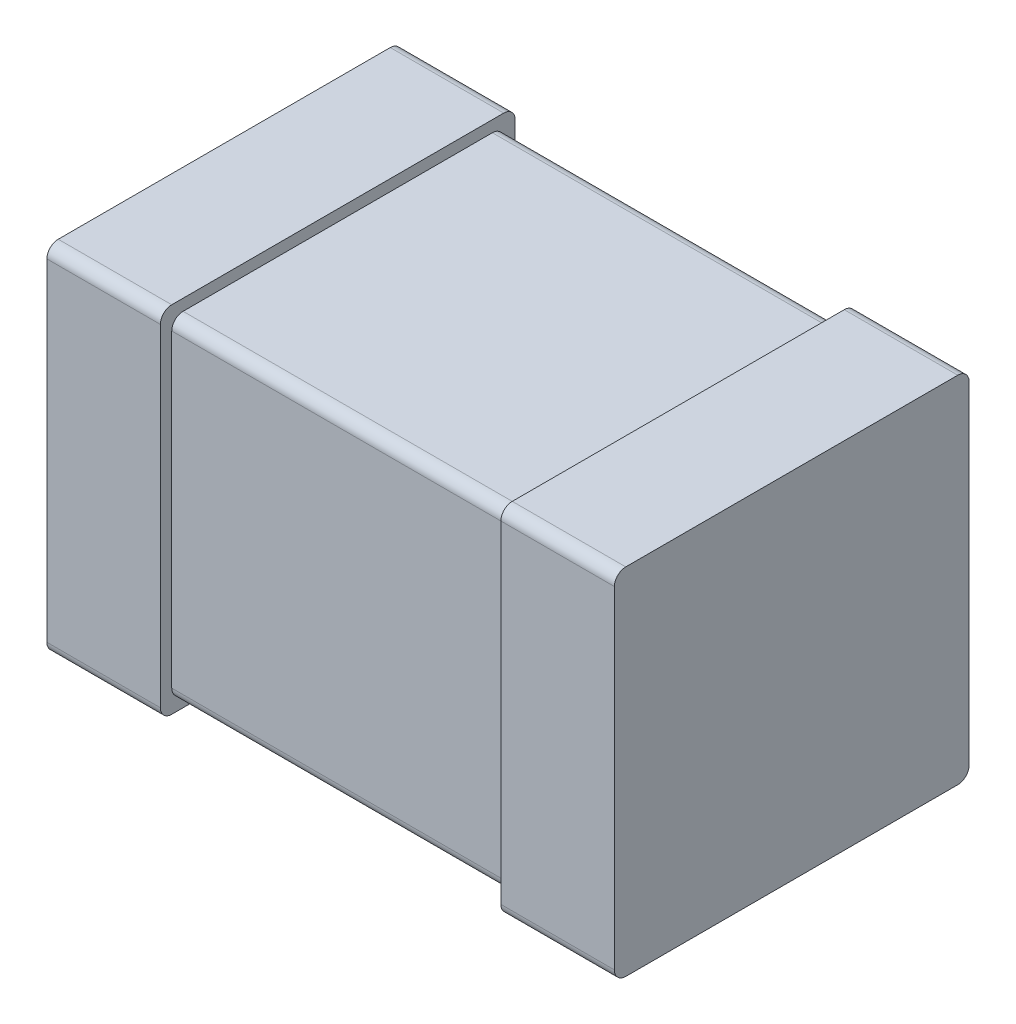
ISO-10303-21;
HEADER;
FILE_DESCRIPTION(('STEP AP214'),'2;1');
FILE_NAME('part.step','',(''),(''),'','','');
FILE_SCHEMA(('AUTOMOTIVE_DESIGN { 1 0 10303 214 1 1 1 1 }'));
ENDSEC;
DATA;
#1=APPLICATION_CONTEXT('core data for automotive mechanical design processes');
#2=APPLICATION_PROTOCOL_DEFINITION('international standard','automotive_design',2000,#1);
#3=PRODUCT_CONTEXT('',#1,'mechanical');
#4=PRODUCT('Part','Part','',(#3));
#5=PRODUCT_RELATED_PRODUCT_CATEGORY('part','',(#4));
#6=PRODUCT_DEFINITION_FORMATION('','',#4);
#7=PRODUCT_DEFINITION_CONTEXT('part definition',#1,'design');
#8=PRODUCT_DEFINITION('design','',#6,#7);
#9=PRODUCT_DEFINITION_SHAPE('','',#8);
#10=(LENGTH_UNIT() NAMED_UNIT(*) SI_UNIT(.MILLI.,.METRE.));
#11=(NAMED_UNIT(*) PLANE_ANGLE_UNIT() SI_UNIT($,.RADIAN.));
#12=(NAMED_UNIT(*) SI_UNIT($,.STERADIAN.) SOLID_ANGLE_UNIT());
#13=UNCERTAINTY_MEASURE_WITH_UNIT(LENGTH_MEASURE(1.E-05),#10,'distance_accuracy_value','');
#14=(GEOMETRIC_REPRESENTATION_CONTEXT(3) GLOBAL_UNCERTAINTY_ASSIGNED_CONTEXT((#13)) GLOBAL_UNIT_ASSIGNED_CONTEXT((#10,
#11,#12)) REPRESENTATION_CONTEXT('',''));
#15=CARTESIAN_POINT('',(0.,0.,0.));
#16=DIRECTION('',(0.,0.,1.));
#17=DIRECTION('',(1.,0.,0.));
#18=AXIS2_PLACEMENT_3D('',#15,#16,#17);
#19=CARTESIAN_POINT('',(1.,-0.625,0.));
#20=DIRECTION('',(1.,0.,0.));
#21=DIRECTION('',(0.,1.,0.));
#22=AXIS2_PLACEMENT_3D('',#19,#20,#21);
#23=PLANE('',#22);
#24=DIRECTION('',(0.,0.,1.));
#25=VECTOR('',#24,1.);
#26=CARTESIAN_POINT('',(1.,-0.625,0.));
#27=LINE('',#26,#25);
#28=CARTESIAN_POINT('',(1.,-0.625,0.04));
#29=VERTEX_POINT('',#28);
#30=CARTESIAN_POINT('',(1.,-0.625,1.21));
#31=VERTEX_POINT('',#30);
#32=EDGE_CURVE('E325',#29,#31,#27,.T.);
#33=ORIENTED_EDGE('',*,*,#32,.F.);
#34=CARTESIAN_POINT('',(1.,-0.585,0.04));
#35=DIRECTION('',(1.,0.,0.));
#36=DIRECTION('',(0.,0.,1.));
#37=AXIS2_PLACEMENT_3D('',#34,#35,#36);
#38=CIRCLE('',#37,0.04);
#39=CARTESIAN_POINT('',(1.,-0.585,0.));
#40=VERTEX_POINT('',#39);
#41=EDGE_CURVE('E358',#29,#40,#38,.T.);
#42=ORIENTED_EDGE('',*,*,#41,.T.);
#43=DIRECTION('',(0.,1.,0.));
#44=VECTOR('',#43,1.);
#45=CARTESIAN_POINT('',(1.,-0.625,0.));
#46=LINE('',#45,#44);
#47=CARTESIAN_POINT('',(1.,0.585,0.));
#48=VERTEX_POINT('',#47);
#49=EDGE_CURVE('E334',#40,#48,#46,.T.);
#50=ORIENTED_EDGE('',*,*,#49,.T.);
#51=CARTESIAN_POINT('',(1.,0.585,0.04));
#52=DIRECTION('',(-1.,0.,0.));
#53=DIRECTION('',(0.,0.,1.));
#54=AXIS2_PLACEMENT_3D('',#51,#52,#53);
#55=CIRCLE('',#54,0.04);
#56=CARTESIAN_POINT('',(1.,0.625,0.04));
#57=VERTEX_POINT('',#56);
#58=EDGE_CURVE('E343',#57,#48,#55,.T.);
#59=ORIENTED_EDGE('',*,*,#58,.F.);
#60=DIRECTION('',(0.,0.,1.));
#61=VECTOR('',#60,1.);
#62=CARTESIAN_POINT('',(1.,0.625,0.));
#63=LINE('',#62,#61);
#64=CARTESIAN_POINT('',(1.,0.625,1.21));
#65=VERTEX_POINT('',#64);
#66=EDGE_CURVE('E11',#57,#65,#63,.T.);
#67=ORIENTED_EDGE('',*,*,#66,.T.);
#68=CARTESIAN_POINT('',(1.,0.585,1.21));
#69=DIRECTION('',(1.,0.,0.));
#70=DIRECTION('',(0.,0.,1.));
#71=AXIS2_PLACEMENT_3D('',#68,#69,#70);
#72=CIRCLE('',#71,0.04);
#73=CARTESIAN_POINT('',(1.,0.585,1.25));
#74=VERTEX_POINT('',#73);
#75=EDGE_CURVE('E347',#65,#74,#72,.T.);
#76=ORIENTED_EDGE('',*,*,#75,.T.);
#77=DIRECTION('',(0.,1.,0.));
#78=VECTOR('',#77,1.);
#79=CARTESIAN_POINT('',(1.,-0.625,1.25));
#80=LINE('',#79,#78);
#81=CARTESIAN_POINT('',(1.,-0.585,1.25));
#82=VERTEX_POINT('',#81);
#83=EDGE_CURVE('E218',#82,#74,#80,.T.);
#84=ORIENTED_EDGE('',*,*,#83,.F.);
#85=CARTESIAN_POINT('',(1.,-0.585,1.21));
#86=DIRECTION('',(-1.,0.,0.));
#87=DIRECTION('',(0.,0.,1.));
#88=AXIS2_PLACEMENT_3D('',#85,#86,#87);
#89=CIRCLE('',#88,0.04);
#90=EDGE_CURVE('E510',#31,#82,#89,.T.);
#91=ORIENTED_EDGE('',*,*,#90,.F.);
#92=EDGE_LOOP('',(#33,#42,#50,#59,#67,#76,#84,#91));
#93=FACE_BOUND('',#92,.T.);
#94=ADVANCED_FACE('F17',(#93),#23,.T.);
#95=CARTESIAN_POINT('',(0.6,0.625,0.));
#96=DIRECTION('',(0.,1.,0.));
#97=DIRECTION('',(1.,0.,0.));
#98=AXIS2_PLACEMENT_3D('',#95,#96,#97);
#99=PLANE('',#98);
#100=ORIENTED_EDGE('',*,*,#66,.F.);
#101=DIRECTION('',(1.,0.,0.));
#102=VECTOR('',#101,1.);
#103=CARTESIAN_POINT('',(0.6,0.625,0.04));
#104=LINE('',#103,#102);
#105=CARTESIAN_POINT('',(0.6,0.625,0.04));
#106=VERTEX_POINT('',#105);
#107=EDGE_CURVE('E21',#106,#57,#104,.T.);
#108=ORIENTED_EDGE('',*,*,#107,.F.);
#109=DIRECTION('',(0.,0.,1.));
#110=VECTOR('',#109,1.);
#111=CARTESIAN_POINT('',(0.6,0.625,0.));
#112=LINE('',#111,#110);
#113=CARTESIAN_POINT('',(0.6,0.625,1.21));
#114=VERTEX_POINT('',#113);
#115=EDGE_CURVE('E230',#106,#114,#112,.T.);
#116=ORIENTED_EDGE('',*,*,#115,.T.);
#117=DIRECTION('',(1.,0.,0.));
#118=VECTOR('',#117,1.);
#119=CARTESIAN_POINT('',(0.6,0.625,1.21));
#120=LINE('',#119,#118);
#121=EDGE_CURVE('E28',#114,#65,#120,.T.);
#122=ORIENTED_EDGE('',*,*,#121,.T.);
#123=EDGE_LOOP('',(#100,#108,#116,#122));
#124=FACE_BOUND('',#123,.T.);
#125=ADVANCED_FACE('F606',(#124),#99,.T.);
#126=CARTESIAN_POINT('',(0.6,0.585,1.21));
#127=DIRECTION('',(1.,0.,0.));
#128=DIRECTION('',(0.,1.,0.));
#129=AXIS2_PLACEMENT_3D('',#126,#127,#128);
#130=CYLINDRICAL_SURFACE('',#129,0.04);
#131=CARTESIAN_POINT('',(0.6,0.585,1.21));
#132=DIRECTION('',(1.,0.,0.));
#133=DIRECTION('',(0.,0.,1.));
#134=AXIS2_PLACEMENT_3D('',#131,#132,#133);
#135=CIRCLE('',#134,0.04);
#136=CARTESIAN_POINT('',(0.6,0.585,1.25));
#137=VERTEX_POINT('',#136);
#138=EDGE_CURVE('E224',#114,#137,#135,.T.);
#139=ORIENTED_EDGE('',*,*,#138,.T.);
#140=DIRECTION('',(1.,0.,0.));
#141=VECTOR('',#140,1.);
#142=CARTESIAN_POINT('',(0.6,0.585,1.25));
#143=LINE('',#142,#141);
#144=EDGE_CURVE('E211',#137,#74,#143,.T.);
#145=ORIENTED_EDGE('',*,*,#144,.T.);
#146=ORIENTED_EDGE('',*,*,#75,.F.);
#147=ORIENTED_EDGE('',*,*,#121,.F.);
#148=EDGE_LOOP('',(#139,#145,#146,#147));
#149=FACE_BOUND('',#148,.T.);
#150=ADVANCED_FACE('F225',(#149),#130,.T.);
#151=CARTESIAN_POINT('',(0.6,0.585,0.04));
#152=DIRECTION('',(1.,0.,0.));
#153=DIRECTION('',(0.,1.,0.));
#154=AXIS2_PLACEMENT_3D('',#151,#152,#153);
#155=CYLINDRICAL_SURFACE('',#154,0.04);
#156=ORIENTED_EDGE('',*,*,#107,.T.);
#157=ORIENTED_EDGE('',*,*,#58,.T.);
#158=DIRECTION('',(1.,0.,0.));
#159=VECTOR('',#158,1.);
#160=CARTESIAN_POINT('',(0.6,0.585,0.));
#161=LINE('',#160,#159);
#162=CARTESIAN_POINT('',(0.6,0.585,0.));
#163=VERTEX_POINT('',#162);
#164=EDGE_CURVE('E338',#163,#48,#161,.T.);
#165=ORIENTED_EDGE('',*,*,#164,.F.);
#166=CARTESIAN_POINT('',(0.6,0.585,0.04));
#167=DIRECTION('',(-1.,0.,0.));
#168=DIRECTION('',(0.,0.,1.));
#169=AXIS2_PLACEMENT_3D('',#166,#167,#168);
#170=CIRCLE('',#169,0.04);
#171=EDGE_CURVE('E313',#106,#163,#170,.T.);
#172=ORIENTED_EDGE('',*,*,#171,.F.);
#173=EDGE_LOOP('',(#156,#157,#165,#172));
#174=FACE_BOUND('',#173,.T.);
#175=ADVANCED_FACE('F526',(#174),#155,.T.);
#176=CARTESIAN_POINT('',(0.6,-0.625,1.25));
#177=DIRECTION('',(0.,0.,1.));
#178=DIRECTION('',(1.,0.,0.));
#179=AXIS2_PLACEMENT_3D('',#176,#177,#178);
#180=PLANE('',#179);
#181=DIRECTION('',(0.,1.,0.));
#182=VECTOR('',#181,1.);
#183=CARTESIAN_POINT('',(0.6,-0.625,1.25));
#184=LINE('',#183,#182);
#185=CARTESIAN_POINT('',(0.6,-0.585,1.25));
#186=VERTEX_POINT('',#185);
#187=EDGE_CURVE('E216',#186,#137,#184,.T.);
#188=ORIENTED_EDGE('',*,*,#187,.F.);
#189=DIRECTION('',(1.,0.,0.));
#190=VECTOR('',#189,1.);
#191=CARTESIAN_POINT('',(0.6,-0.585,1.25));
#192=LINE('',#191,#190);
#193=EDGE_CURVE('E385',#186,#82,#192,.T.);
#194=ORIENTED_EDGE('',*,*,#193,.T.);
#195=ORIENTED_EDGE('',*,*,#83,.T.);
#196=ORIENTED_EDGE('',*,*,#144,.F.);
#197=EDGE_LOOP('',(#188,#194,#195,#196));
#198=FACE_BOUND('',#197,.T.);
#199=ADVANCED_FACE('F213',(#198),#180,.T.);
#200=CARTESIAN_POINT('',(0.6,-0.625,0.));
#201=DIRECTION('',(0.,0.,1.));
#202=DIRECTION('',(1.,0.,0.));
#203=AXIS2_PLACEMENT_3D('',#200,#201,#202);
#204=PLANE('',#203);
#205=ORIENTED_EDGE('',*,*,#164,.T.);
#206=ORIENTED_EDGE('',*,*,#49,.F.);
#207=DIRECTION('',(1.,0.,0.));
#208=VECTOR('',#207,1.);
#209=CARTESIAN_POINT('',(0.6,-0.585,0.));
#210=LINE('',#209,#208);
#211=CARTESIAN_POINT('',(0.6,-0.585,0.));
#212=VERTEX_POINT('',#211);
#213=EDGE_CURVE('E329',#212,#40,#210,.T.);
#214=ORIENTED_EDGE('',*,*,#213,.F.);
#215=DIRECTION('',(0.,1.,0.));
#216=VECTOR('',#215,1.);
#217=CARTESIAN_POINT('',(0.6,-0.625,0.));
#218=LINE('',#217,#216);
#219=EDGE_CURVE('E285',#212,#163,#218,.T.);
#220=ORIENTED_EDGE('',*,*,#219,.T.);
#221=EDGE_LOOP('',(#205,#206,#214,#220));
#222=FACE_BOUND('',#221,.T.);
#223=ADVANCED_FACE('F528',(#222),#204,.F.);
#224=CARTESIAN_POINT('',(0.6,-0.585,1.21));
#225=DIRECTION('',(1.,0.,0.));
#226=DIRECTION('',(0.,-1.,0.));
#227=AXIS2_PLACEMENT_3D('',#224,#225,#226);
#228=CYLINDRICAL_SURFACE('',#227,0.04);
#229=DIRECTION('',(1.,0.,0.));
#230=VECTOR('',#229,1.);
#231=CARTESIAN_POINT('',(0.6,-0.625,1.21));
#232=LINE('',#231,#230);
#233=CARTESIAN_POINT('',(0.6,-0.625,1.21));
#234=VERTEX_POINT('',#233);
#235=EDGE_CURVE('E419',#234,#31,#232,.T.);
#236=ORIENTED_EDGE('',*,*,#235,.T.);
#237=ORIENTED_EDGE('',*,*,#90,.T.);
#238=ORIENTED_EDGE('',*,*,#193,.F.);
#239=CARTESIAN_POINT('',(0.6,-0.585,1.21));
#240=DIRECTION('',(-1.,0.,0.));
#241=DIRECTION('',(0.,0.,1.));
#242=AXIS2_PLACEMENT_3D('',#239,#240,#241);
#243=CIRCLE('',#242,0.04);
#244=EDGE_CURVE('E235',#234,#186,#243,.T.);
#245=ORIENTED_EDGE('',*,*,#244,.F.);
#246=EDGE_LOOP('',(#236,#237,#238,#245));
#247=FACE_BOUND('',#246,.T.);
#248=ADVANCED_FACE('F537',(#247),#228,.T.);
#249=CARTESIAN_POINT('',(0.6,-0.585,0.04));
#250=DIRECTION('',(1.,0.,0.));
#251=DIRECTION('',(0.,-1.,0.));
#252=AXIS2_PLACEMENT_3D('',#249,#250,#251);
#253=CYLINDRICAL_SURFACE('',#252,0.04);
#254=CARTESIAN_POINT('',(0.6,-0.585,0.04));
#255=DIRECTION('',(1.,0.,0.));
#256=DIRECTION('',(0.,0.,1.));
#257=AXIS2_PLACEMENT_3D('',#254,#255,#256);
#258=CIRCLE('',#257,0.04);
#259=CARTESIAN_POINT('',(0.6,-0.625,0.04));
#260=VERTEX_POINT('',#259);
#261=EDGE_CURVE('E280',#260,#212,#258,.T.);
#262=ORIENTED_EDGE('',*,*,#261,.T.);
#263=ORIENTED_EDGE('',*,*,#213,.T.);
#264=ORIENTED_EDGE('',*,*,#41,.F.);
#265=DIRECTION('',(1.,0.,0.));
#266=VECTOR('',#265,1.);
#267=CARTESIAN_POINT('',(0.6,-0.625,0.04));
#268=LINE('',#267,#266);
#269=EDGE_CURVE('E330',#260,#29,#268,.T.);
#270=ORIENTED_EDGE('',*,*,#269,.F.);
#271=EDGE_LOOP('',(#262,#263,#264,#270));
#272=FACE_BOUND('',#271,.T.);
#273=ADVANCED_FACE('F530',(#272),#253,.T.);
#274=CARTESIAN_POINT('',(0.6,-0.625,0.));
#275=DIRECTION('',(0.,1.,0.));
#276=DIRECTION('',(1.,0.,0.));
#277=AXIS2_PLACEMENT_3D('',#274,#275,#276);
#278=PLANE('',#277);
#279=ORIENTED_EDGE('',*,*,#235,.F.);
#280=DIRECTION('',(0.,0.,1.));
#281=VECTOR('',#280,1.);
#282=CARTESIAN_POINT('',(0.6,-0.625,0.));
#283=LINE('',#282,#281);
#284=EDGE_CURVE('E284',#260,#234,#283,.T.);
#285=ORIENTED_EDGE('',*,*,#284,.F.);
#286=ORIENTED_EDGE('',*,*,#269,.T.);
#287=ORIENTED_EDGE('',*,*,#32,.T.);
#288=EDGE_LOOP('',(#279,#285,#286,#287));
#289=FACE_BOUND('',#288,.T.);
#290=ADVANCED_FACE('F655',(#289),#278,.F.);
#291=CARTESIAN_POINT('',(0.6,-0.625,0.));
#292=DIRECTION('',(1.,0.,0.));
#293=DIRECTION('',(0.,1.,0.));
#294=AXIS2_PLACEMENT_3D('',#291,#292,#293);
#295=PLANE('',#294);
#296=DIRECTION('',(0.,1.,0.));
#297=VECTOR('',#296,1.);
#298=CARTESIAN_POINT('',(0.6,-0.585,0.04));
#299=LINE('',#298,#297);
#300=CARTESIAN_POINT('',(0.6,-0.545,0.04));
#301=VERTEX_POINT('',#300);
#302=CARTESIAN_POINT('',(0.6,0.545,0.04));
#303=VERTEX_POINT('',#302);
#304=EDGE_CURVE('E291',#301,#303,#299,.T.);
#305=ORIENTED_EDGE('',*,*,#304,.T.);
#306=CARTESIAN_POINT('',(0.6,0.545,0.08));
#307=DIRECTION('',(-1.,0.,0.));
#308=DIRECTION('',(0.,0.,1.));
#309=AXIS2_PLACEMENT_3D('',#306,#307,#308);
#310=CIRCLE('',#309,0.04);
#311=CARTESIAN_POINT('',(0.6,0.585,0.08));
#312=VERTEX_POINT('',#311);
#313=EDGE_CURVE('E290',#312,#303,#310,.T.);
#314=ORIENTED_EDGE('',*,*,#313,.F.);
#315=DIRECTION('',(0.,0.,1.));
#316=VECTOR('',#315,1.);
#317=CARTESIAN_POINT('',(0.6,0.585,0.04));
#318=LINE('',#317,#316);
#319=CARTESIAN_POINT('',(0.6,0.585,1.17));
#320=VERTEX_POINT('',#319);
#321=EDGE_CURVE('E295',#312,#320,#318,.T.);
#322=ORIENTED_EDGE('',*,*,#321,.T.);
#323=CARTESIAN_POINT('',(0.6,0.545,1.17));
#324=DIRECTION('',(1.,0.,0.));
#325=DIRECTION('',(0.,0.,1.));
#326=AXIS2_PLACEMENT_3D('',#323,#324,#325);
#327=CIRCLE('',#326,0.04);
#328=CARTESIAN_POINT('',(0.6,0.545,1.21));
#329=VERTEX_POINT('',#328);
#330=EDGE_CURVE('E248',#320,#329,#327,.T.);
#331=ORIENTED_EDGE('',*,*,#330,.T.);
#332=DIRECTION('',(0.,1.,0.));
#333=VECTOR('',#332,1.);
#334=CARTESIAN_POINT('',(0.6,-0.585,1.21));
#335=LINE('',#334,#333);
#336=CARTESIAN_POINT('',(0.6,-0.545,1.21));
#337=VERTEX_POINT('',#336);
#338=EDGE_CURVE('E373',#337,#329,#335,.T.);
#339=ORIENTED_EDGE('',*,*,#338,.F.);
#340=CARTESIAN_POINT('',(0.6,-0.545,1.17));
#341=DIRECTION('',(-1.,0.,0.));
#342=DIRECTION('',(0.,0.,1.));
#343=AXIS2_PLACEMENT_3D('',#340,#341,#342);
#344=CIRCLE('',#343,0.04);
#345=CARTESIAN_POINT('',(0.6,-0.585,1.17));
#346=VERTEX_POINT('',#345);
#347=EDGE_CURVE('E250',#346,#337,#344,.T.);
#348=ORIENTED_EDGE('',*,*,#347,.F.);
#349=DIRECTION('',(0.,0.,1.));
#350=VECTOR('',#349,1.);
#351=CARTESIAN_POINT('',(0.6,-0.585,0.04));
#352=LINE('',#351,#350);
#353=CARTESIAN_POINT('',(0.6,-0.585,0.08));
#354=VERTEX_POINT('',#353);
#355=EDGE_CURVE('E241',#354,#346,#352,.T.);
#356=ORIENTED_EDGE('',*,*,#355,.F.);
#357=CARTESIAN_POINT('',(0.6,-0.545,0.08));
#358=DIRECTION('',(1.,0.,0.));
#359=DIRECTION('',(0.,0.,1.));
#360=AXIS2_PLACEMENT_3D('',#357,#358,#359);
#361=CIRCLE('',#360,0.04);
#362=EDGE_CURVE('E320',#354,#301,#361,.T.);
#363=ORIENTED_EDGE('',*,*,#362,.T.);
#364=EDGE_LOOP('',(#305,#314,#322,#331,#339,#348,#356,#363));
#365=FACE_BOUND('',#364,.T.);
#366=ORIENTED_EDGE('',*,*,#244,.T.);
#367=ORIENTED_EDGE('',*,*,#187,.T.);
#368=ORIENTED_EDGE('',*,*,#138,.F.);
#369=ORIENTED_EDGE('',*,*,#115,.F.);
#370=ORIENTED_EDGE('',*,*,#171,.T.);
#371=ORIENTED_EDGE('',*,*,#219,.F.);
#372=ORIENTED_EDGE('',*,*,#261,.F.);
#373=ORIENTED_EDGE('',*,*,#284,.T.);
#374=EDGE_LOOP('',(#366,#367,#368,#369,#370,#371,#372,#373));
#375=FACE_BOUND('',#374,.T.);
#376=ADVANCED_FACE('F232',(#365,#375),#295,.F.);
#377=CARTESIAN_POINT('',(-0.6,-0.585,0.04));
#378=DIRECTION('',(0.,1.,0.));
#379=DIRECTION('',(1.,0.,0.));
#380=AXIS2_PLACEMENT_3D('',#377,#378,#379);
#381=PLANE('',#380);
#382=DIRECTION('',(1.,0.,0.));
#383=VECTOR('',#382,1.);
#384=CARTESIAN_POINT('',(-0.6,-0.585,1.17));
#385=LINE('',#384,#383);
#386=CARTESIAN_POINT('',(-0.6,-0.585,1.17));
#387=VERTEX_POINT('',#386);
#388=EDGE_CURVE('E101',#387,#346,#385,.T.);
#389=ORIENTED_EDGE('',*,*,#388,.F.);
#390=DIRECTION('',(0.,0.,1.));
#391=VECTOR('',#390,1.);
#392=CARTESIAN_POINT('',(-0.6,-0.585,0.04));
#393=LINE('',#392,#391);
#394=CARTESIAN_POINT('',(-0.6,-0.585,0.08));
#395=VERTEX_POINT('',#394);
#396=EDGE_CURVE('E279',#395,#387,#393,.T.);
#397=ORIENTED_EDGE('',*,*,#396,.F.);
#398=DIRECTION('',(1.,0.,0.));
#399=VECTOR('',#398,1.);
#400=CARTESIAN_POINT('',(-0.6,-0.585,0.08));
#401=LINE('',#400,#399);
#402=EDGE_CURVE('E324',#395,#354,#401,.T.);
#403=ORIENTED_EDGE('',*,*,#402,.T.);
#404=ORIENTED_EDGE('',*,*,#355,.T.);
#405=EDGE_LOOP('',(#389,#397,#403,#404));
#406=FACE_BOUND('',#405,.T.);
#407=ADVANCED_FACE('F625',(#406),#381,.F.);
#408=CARTESIAN_POINT('',(-0.6,-0.545,1.17));
#409=DIRECTION('',(1.,0.,0.));
#410=DIRECTION('',(0.,-1.,0.));
#411=AXIS2_PLACEMENT_3D('',#408,#409,#410);
#412=CYLINDRICAL_SURFACE('',#411,0.04);
#413=ORIENTED_EDGE('',*,*,#388,.T.);
#414=ORIENTED_EDGE('',*,*,#347,.T.);
#415=DIRECTION('',(1.,0.,0.));
#416=VECTOR('',#415,1.);
#417=CARTESIAN_POINT('',(-0.6,-0.545,1.21));
#418=LINE('',#417,#416);
#419=CARTESIAN_POINT('',(-0.6,-0.545,1.21));
#420=VERTEX_POINT('',#419);
#421=EDGE_CURVE('E369',#420,#337,#418,.T.);
#422=ORIENTED_EDGE('',*,*,#421,.F.);
#423=CARTESIAN_POINT('',(-0.6,-0.545,1.17));
#424=DIRECTION('',(-1.,0.,0.));
#425=DIRECTION('',(0.,0.,1.));
#426=AXIS2_PLACEMENT_3D('',#423,#424,#425);
#427=CIRCLE('',#426,0.04);
#428=EDGE_CURVE('E274',#387,#420,#427,.T.);
#429=ORIENTED_EDGE('',*,*,#428,.F.);
#430=EDGE_LOOP('',(#413,#414,#422,#429));
#431=FACE_BOUND('',#430,.T.);
#432=ADVANCED_FACE('F453',(#431),#412,.T.);
#433=CARTESIAN_POINT('',(-0.6,-0.585,1.21));
#434=DIRECTION('',(0.,0.,1.));
#435=DIRECTION('',(1.,0.,0.));
#436=AXIS2_PLACEMENT_3D('',#433,#434,#435);
#437=PLANE('',#436);
#438=DIRECTION('',(0.,1.,0.));
#439=VECTOR('',#438,1.);
#440=CARTESIAN_POINT('',(-0.6,-0.585,1.21));
#441=LINE('',#440,#439);
#442=CARTESIAN_POINT('',(-0.6,0.545,1.21));
#443=VERTEX_POINT('',#442);
#444=EDGE_CURVE('E278',#420,#443,#441,.T.);
#445=ORIENTED_EDGE('',*,*,#444,.F.);
#446=ORIENTED_EDGE('',*,*,#421,.T.);
#447=ORIENTED_EDGE('',*,*,#338,.T.);
#448=DIRECTION('',(1.,0.,0.));
#449=VECTOR('',#448,1.);
#450=CARTESIAN_POINT('',(-0.6,0.545,1.21));
#451=LINE('',#450,#449);
#452=EDGE_CURVE('E245',#443,#329,#451,.T.);
#453=ORIENTED_EDGE('',*,*,#452,.F.);
#454=EDGE_LOOP('',(#445,#446,#447,#453));
#455=FACE_BOUND('',#454,.T.);
#456=ADVANCED_FACE('F435',(#455),#437,.T.);
#457=CARTESIAN_POINT('',(-0.6,0.545,1.17));
#458=DIRECTION('',(1.,0.,0.));
#459=DIRECTION('',(0.,1.,0.));
#460=AXIS2_PLACEMENT_3D('',#457,#458,#459);
#461=CYLINDRICAL_SURFACE('',#460,0.04);
#462=CARTESIAN_POINT('',(-0.6,0.545,1.17));
#463=DIRECTION('',(1.,0.,0.));
#464=DIRECTION('',(0.,0.,1.));
#465=AXIS2_PLACEMENT_3D('',#462,#463,#464);
#466=CIRCLE('',#465,0.04);
#467=CARTESIAN_POINT('',(-0.6,0.585,1.17));
#468=VERTEX_POINT('',#467);
#469=EDGE_CURVE('E304',#468,#443,#466,.T.);
#470=ORIENTED_EDGE('',*,*,#469,.T.);
#471=ORIENTED_EDGE('',*,*,#452,.T.);
#472=ORIENTED_EDGE('',*,*,#330,.F.);
#473=DIRECTION('',(1.,0.,0.));
#474=VECTOR('',#473,1.);
#475=CARTESIAN_POINT('',(-0.6,0.585,1.17));
#476=LINE('',#475,#474);
#477=EDGE_CURVE('E249',#468,#320,#476,.T.);
#478=ORIENTED_EDGE('',*,*,#477,.F.);
#479=EDGE_LOOP('',(#470,#471,#472,#478));
#480=FACE_BOUND('',#479,.T.);
#481=ADVANCED_FACE('F442',(#480),#461,.T.);
#482=CARTESIAN_POINT('',(-0.6,0.585,0.04));
#483=DIRECTION('',(0.,1.,0.));
#484=DIRECTION('',(1.,0.,0.));
#485=AXIS2_PLACEMENT_3D('',#482,#483,#484);
#486=PLANE('',#485);
#487=ORIENTED_EDGE('',*,*,#321,.F.);
#488=DIRECTION('',(1.,0.,0.));
#489=VECTOR('',#488,1.);
#490=CARTESIAN_POINT('',(-0.6,0.585,0.08));
#491=LINE('',#490,#489);
#492=CARTESIAN_POINT('',(-0.6,0.585,0.08));
#493=VERTEX_POINT('',#492);
#494=EDGE_CURVE('E286',#493,#312,#491,.T.);
#495=ORIENTED_EDGE('',*,*,#494,.F.);
#496=DIRECTION('',(0.,0.,1.));
#497=VECTOR('',#496,1.);
#498=CARTESIAN_POINT('',(-0.6,0.585,0.04));
#499=LINE('',#498,#497);
#500=EDGE_CURVE('E365',#493,#468,#499,.T.);
#501=ORIENTED_EDGE('',*,*,#500,.T.);
#502=ORIENTED_EDGE('',*,*,#477,.T.);
#503=EDGE_LOOP('',(#487,#495,#501,#502));
#504=FACE_BOUND('',#503,.T.);
#505=ADVANCED_FACE('F601',(#504),#486,.T.);
#506=CARTESIAN_POINT('',(-0.6,0.545,0.08));
#507=DIRECTION('',(1.,0.,0.));
#508=DIRECTION('',(0.,1.,0.));
#509=AXIS2_PLACEMENT_3D('',#506,#507,#508);
#510=CYLINDRICAL_SURFACE('',#509,0.04);
#511=ORIENTED_EDGE('',*,*,#494,.T.);
#512=ORIENTED_EDGE('',*,*,#313,.T.);
#513=DIRECTION('',(1.,0.,0.));
#514=VECTOR('',#513,1.);
#515=CARTESIAN_POINT('',(-0.6,0.545,0.04));
#516=LINE('',#515,#514);
#517=CARTESIAN_POINT('',(-0.6,0.545,0.04));
#518=VERTEX_POINT('',#517);
#519=EDGE_CURVE('E545',#518,#303,#516,.T.);
#520=ORIENTED_EDGE('',*,*,#519,.F.);
#521=CARTESIAN_POINT('',(-0.6,0.545,0.08));
#522=DIRECTION('',(-1.,0.,0.));
#523=DIRECTION('',(0.,0.,1.));
#524=AXIS2_PLACEMENT_3D('',#521,#522,#523);
#525=CIRCLE('',#524,0.04);
#526=EDGE_CURVE('E362',#493,#518,#525,.T.);
#527=ORIENTED_EDGE('',*,*,#526,.F.);
#528=EDGE_LOOP('',(#511,#512,#520,#527));
#529=FACE_BOUND('',#528,.T.);
#530=ADVANCED_FACE('F592',(#529),#510,.T.);
#531=CARTESIAN_POINT('',(-0.6,-0.585,0.04));
#532=DIRECTION('',(0.,0.,1.));
#533=DIRECTION('',(1.,0.,0.));
#534=AXIS2_PLACEMENT_3D('',#531,#532,#533);
#535=PLANE('',#534);
#536=ORIENTED_EDGE('',*,*,#519,.T.);
#537=ORIENTED_EDGE('',*,*,#304,.F.);
#538=DIRECTION('',(1.,0.,0.));
#539=VECTOR('',#538,1.);
#540=CARTESIAN_POINT('',(-0.6,-0.545,0.04));
#541=LINE('',#540,#539);
#542=CARTESIAN_POINT('',(-0.6,-0.545,0.04));
#543=VERTEX_POINT('',#542);
#544=EDGE_CURVE('E117',#543,#301,#541,.T.);
#545=ORIENTED_EDGE('',*,*,#544,.F.);
#546=DIRECTION('',(0.,1.,0.));
#547=VECTOR('',#546,1.);
#548=CARTESIAN_POINT('',(-0.6,-0.585,0.04));
#549=LINE('',#548,#547);
#550=EDGE_CURVE('E359',#543,#518,#549,.T.);
#551=ORIENTED_EDGE('',*,*,#550,.T.);
#552=EDGE_LOOP('',(#536,#537,#545,#551));
#553=FACE_BOUND('',#552,.T.);
#554=ADVANCED_FACE('F589',(#553),#535,.F.);
#555=CARTESIAN_POINT('',(-0.6,-0.545,0.08));
#556=DIRECTION('',(1.,0.,0.));
#557=DIRECTION('',(0.,-1.,0.));
#558=AXIS2_PLACEMENT_3D('',#555,#556,#557);
#559=CYLINDRICAL_SURFACE('',#558,0.04);
#560=CARTESIAN_POINT('',(-0.6,-0.545,0.08));
#561=DIRECTION('',(1.,0.,0.));
#562=DIRECTION('',(0.,0.,1.));
#563=AXIS2_PLACEMENT_3D('',#560,#561,#562);
#564=CIRCLE('',#563,0.04);
#565=EDGE_CURVE('E516',#395,#543,#564,.T.);
#566=ORIENTED_EDGE('',*,*,#565,.T.);
#567=ORIENTED_EDGE('',*,*,#544,.T.);
#568=ORIENTED_EDGE('',*,*,#362,.F.);
#569=ORIENTED_EDGE('',*,*,#402,.F.);
#570=EDGE_LOOP('',(#566,#567,#568,#569));
#571=FACE_BOUND('',#570,.T.);
#572=ADVANCED_FACE('F591',(#571),#559,.T.);
#573=CARTESIAN_POINT('',(-0.6,-0.625,0.));
#574=DIRECTION('',(1.,0.,0.));
#575=DIRECTION('',(0.,1.,0.));
#576=AXIS2_PLACEMENT_3D('',#573,#574,#575);
#577=PLANE('',#576);
#578=ORIENTED_EDGE('',*,*,#565,.F.);
#579=ORIENTED_EDGE('',*,*,#396,.T.);
#580=ORIENTED_EDGE('',*,*,#428,.T.);
#581=ORIENTED_EDGE('',*,*,#444,.T.);
#582=ORIENTED_EDGE('',*,*,#469,.F.);
#583=ORIENTED_EDGE('',*,*,#500,.F.);
#584=ORIENTED_EDGE('',*,*,#526,.T.);
#585=ORIENTED_EDGE('',*,*,#550,.F.);
#586=EDGE_LOOP('',(#578,#579,#580,#581,#582,#583,#584,#585));
#587=FACE_BOUND('',#586,.T.);
#588=DIRECTION('',(0.,0.,1.));
#589=VECTOR('',#588,1.);
#590=CARTESIAN_POINT('',(-0.6,-0.625,0.));
#591=LINE('',#590,#589);
#592=CARTESIAN_POINT('',(-0.6,-0.625,0.04));
#593=VERTEX_POINT('',#592);
#594=CARTESIAN_POINT('',(-0.6,-0.625,1.21));
#595=VERTEX_POINT('',#594);
#596=EDGE_CURVE('E319',#593,#595,#591,.T.);
#597=ORIENTED_EDGE('',*,*,#596,.F.);
#598=CARTESIAN_POINT('',(-0.6,-0.585,0.04));
#599=DIRECTION('',(1.,0.,0.));
#600=DIRECTION('',(0.,0.,1.));
#601=AXIS2_PLACEMENT_3D('',#598,#599,#600);
#602=CIRCLE('',#601,0.04);
#603=CARTESIAN_POINT('',(-0.6,-0.585,0.));
#604=VERTEX_POINT('',#603);
#605=EDGE_CURVE('E318',#593,#604,#602,.T.);
#606=ORIENTED_EDGE('',*,*,#605,.T.);
#607=DIRECTION('',(0.,1.,0.));
#608=VECTOR('',#607,1.);
#609=CARTESIAN_POINT('',(-0.6,-0.625,0.));
#610=LINE('',#609,#608);
#611=CARTESIAN_POINT('',(-0.6,0.585,0.));
#612=VERTEX_POINT('',#611);
#613=EDGE_CURVE('E263',#604,#612,#610,.T.);
#614=ORIENTED_EDGE('',*,*,#613,.T.);
#615=CARTESIAN_POINT('',(-0.6,0.585,0.04));
#616=DIRECTION('',(-1.,0.,0.));
#617=DIRECTION('',(0.,0.,1.));
#618=AXIS2_PLACEMENT_3D('',#615,#616,#617);
#619=CIRCLE('',#618,0.04);
#620=CARTESIAN_POINT('',(-0.6,0.625,0.04));
#621=VERTEX_POINT('',#620);
#622=EDGE_CURVE('E300',#621,#612,#619,.T.);
#623=ORIENTED_EDGE('',*,*,#622,.F.);
#624=DIRECTION('',(0.,0.,1.));
#625=VECTOR('',#624,1.);
#626=CARTESIAN_POINT('',(-0.6,0.625,0.));
#627=LINE('',#626,#625);
#628=CARTESIAN_POINT('',(-0.6,0.625,1.21));
#629=VERTEX_POINT('',#628);
#630=EDGE_CURVE('E396',#621,#629,#627,.T.);
#631=ORIENTED_EDGE('',*,*,#630,.T.);
#632=CARTESIAN_POINT('',(-0.6,0.585,1.21));
#633=DIRECTION('',(1.,0.,0.));
#634=DIRECTION('',(0.,0.,1.));
#635=AXIS2_PLACEMENT_3D('',#632,#633,#634);
#636=CIRCLE('',#635,0.04);
#637=CARTESIAN_POINT('',(-0.6,0.585,1.25));
#638=VERTEX_POINT('',#637);
#639=EDGE_CURVE('E296',#629,#638,#636,.T.);
#640=ORIENTED_EDGE('',*,*,#639,.T.);
#641=DIRECTION('',(0.,1.,0.));
#642=VECTOR('',#641,1.);
#643=CARTESIAN_POINT('',(-0.6,-0.625,1.25));
#644=LINE('',#643,#642);
#645=CARTESIAN_POINT('',(-0.6,-0.585,1.25));
#646=VERTEX_POINT('',#645);
#647=EDGE_CURVE('E376',#646,#638,#644,.T.);
#648=ORIENTED_EDGE('',*,*,#647,.F.);
#649=CARTESIAN_POINT('',(-0.6,-0.585,1.21));
#650=DIRECTION('',(-1.,0.,0.));
#651=DIRECTION('',(0.,0.,1.));
#652=AXIS2_PLACEMENT_3D('',#649,#650,#651);
#653=CIRCLE('',#652,0.04);
#654=EDGE_CURVE('E397',#595,#646,#653,.T.);
#655=ORIENTED_EDGE('',*,*,#654,.F.);
#656=EDGE_LOOP('',(#597,#606,#614,#623,#631,#640,#648,#655));
#657=FACE_BOUND('',#656,.T.);
#658=ADVANCED_FACE('F449',(#587,#657),#577,.T.);
#659=CARTESIAN_POINT('',(-1.,0.625,0.));
#660=DIRECTION('',(0.,1.,0.));
#661=DIRECTION('',(1.,0.,0.));
#662=AXIS2_PLACEMENT_3D('',#659,#660,#661);
#663=PLANE('',#662);
#664=ORIENTED_EDGE('',*,*,#630,.F.);
#665=DIRECTION('',(1.,0.,0.));
#666=VECTOR('',#665,1.);
#667=CARTESIAN_POINT('',(-1.,0.625,0.04));
#668=LINE('',#667,#666);
#669=CARTESIAN_POINT('',(-1.,0.625,0.04));
#670=VERTEX_POINT('',#669);
#671=EDGE_CURVE('E350',#670,#621,#668,.T.);
#672=ORIENTED_EDGE('',*,*,#671,.F.);
#673=DIRECTION('',(0.,0.,1.));
#674=VECTOR('',#673,1.);
#675=CARTESIAN_POINT('',(-1.,0.625,0.));
#676=LINE('',#675,#674);
#677=CARTESIAN_POINT('',(-1.,0.625,1.21));
#678=VERTEX_POINT('',#677);
#679=EDGE_CURVE('E309',#670,#678,#676,.T.);
#680=ORIENTED_EDGE('',*,*,#679,.T.);
#681=DIRECTION('',(1.,0.,0.));
#682=VECTOR('',#681,1.);
#683=CARTESIAN_POINT('',(-1.,0.625,1.21));
#684=LINE('',#683,#682);
#685=EDGE_CURVE('E299',#678,#629,#684,.T.);
#686=ORIENTED_EDGE('',*,*,#685,.T.);
#687=EDGE_LOOP('',(#664,#672,#680,#686));
#688=FACE_BOUND('',#687,.T.);
#689=ADVANCED_FACE('F559',(#688),#663,.T.);
#690=CARTESIAN_POINT('',(-1.,0.585,1.21));
#691=DIRECTION('',(1.,0.,0.));
#692=DIRECTION('',(0.,1.,0.));
#693=AXIS2_PLACEMENT_3D('',#690,#691,#692);
#694=CYLINDRICAL_SURFACE('',#693,0.04);
#695=CARTESIAN_POINT('',(-1.,0.585,1.21));
#696=DIRECTION('',(1.,0.,0.));
#697=DIRECTION('',(0.,0.,1.));
#698=AXIS2_PLACEMENT_3D('',#695,#696,#697);
#699=CIRCLE('',#698,0.04);
#700=CARTESIAN_POINT('',(-1.,0.585,1.25));
#701=VERTEX_POINT('',#700);
#702=EDGE_CURVE('E305',#678,#701,#699,.T.);
#703=ORIENTED_EDGE('',*,*,#702,.T.);
#704=DIRECTION('',(1.,0.,0.));
#705=VECTOR('',#704,1.);
#706=CARTESIAN_POINT('',(-1.,0.585,1.25));
#707=LINE('',#706,#705);
#708=EDGE_CURVE('E354',#701,#638,#707,.T.);
#709=ORIENTED_EDGE('',*,*,#708,.T.);
#710=ORIENTED_EDGE('',*,*,#639,.F.);
#711=ORIENTED_EDGE('',*,*,#685,.F.);
#712=EDGE_LOOP('',(#703,#709,#710,#711));
#713=FACE_BOUND('',#712,.T.);
#714=ADVANCED_FACE('F576',(#713),#694,.T.);
#715=CARTESIAN_POINT('',(-1.,0.585,0.04));
#716=DIRECTION('',(1.,0.,0.));
#717=DIRECTION('',(0.,1.,0.));
#718=AXIS2_PLACEMENT_3D('',#715,#716,#717);
#719=CYLINDRICAL_SURFACE('',#718,0.04);
#720=ORIENTED_EDGE('',*,*,#671,.T.);
#721=ORIENTED_EDGE('',*,*,#622,.T.);
#722=DIRECTION('',(1.,0.,0.));
#723=VECTOR('',#722,1.);
#724=CARTESIAN_POINT('',(-1.,0.585,0.));
#725=LINE('',#724,#723);
#726=CARTESIAN_POINT('',(-1.,0.585,0.));
#727=VERTEX_POINT('',#726);
#728=EDGE_CURVE('E259',#727,#612,#725,.T.);
#729=ORIENTED_EDGE('',*,*,#728,.F.);
#730=CARTESIAN_POINT('',(-1.,0.585,0.04));
#731=DIRECTION('',(-1.,0.,0.));
#732=DIRECTION('',(0.,0.,1.));
#733=AXIS2_PLACEMENT_3D('',#730,#731,#732);
#734=CIRCLE('',#733,0.04);
#735=EDGE_CURVE('E268',#670,#727,#734,.T.);
#736=ORIENTED_EDGE('',*,*,#735,.F.);
#737=EDGE_LOOP('',(#720,#721,#729,#736));
#738=FACE_BOUND('',#737,.T.);
#739=ADVANCED_FACE('F556',(#738),#719,.T.);
#740=CARTESIAN_POINT('',(-1.,-0.625,1.25));
#741=DIRECTION('',(0.,0.,1.));
#742=DIRECTION('',(1.,0.,0.));
#743=AXIS2_PLACEMENT_3D('',#740,#741,#742);
#744=PLANE('',#743);
#745=DIRECTION('',(0.,1.,0.));
#746=VECTOR('',#745,1.);
#747=CARTESIAN_POINT('',(-1.,-0.625,1.25));
#748=LINE('',#747,#746);
#749=CARTESIAN_POINT('',(-1.,-0.585,1.25));
#750=VERTEX_POINT('',#749);
#751=EDGE_CURVE('E310',#750,#701,#748,.T.);
#752=ORIENTED_EDGE('',*,*,#751,.F.);
#753=DIRECTION('',(1.,0.,0.));
#754=VECTOR('',#753,1.);
#755=CARTESIAN_POINT('',(-1.,-0.585,1.25));
#756=LINE('',#755,#754);
#757=EDGE_CURVE('E264',#750,#646,#756,.T.);
#758=ORIENTED_EDGE('',*,*,#757,.T.);
#759=ORIENTED_EDGE('',*,*,#647,.T.);
#760=ORIENTED_EDGE('',*,*,#708,.F.);
#761=EDGE_LOOP('',(#752,#758,#759,#760));
#762=FACE_BOUND('',#761,.T.);
#763=ADVANCED_FACE('F574',(#762),#744,.T.);
#764=CARTESIAN_POINT('',(-1.,-0.625,0.));
#765=DIRECTION('',(0.,0.,1.));
#766=DIRECTION('',(1.,0.,0.));
#767=AXIS2_PLACEMENT_3D('',#764,#765,#766);
#768=PLANE('',#767);
#769=ORIENTED_EDGE('',*,*,#728,.T.);
#770=ORIENTED_EDGE('',*,*,#613,.F.);
#771=DIRECTION('',(1.,0.,0.));
#772=VECTOR('',#771,1.);
#773=CARTESIAN_POINT('',(-1.,-0.585,0.));
#774=LINE('',#773,#772);
#775=CARTESIAN_POINT('',(-1.,-0.585,0.));
#776=VERTEX_POINT('',#775);
#777=EDGE_CURVE('E314',#776,#604,#774,.T.);
#778=ORIENTED_EDGE('',*,*,#777,.F.);
#779=DIRECTION('',(0.,1.,0.));
#780=VECTOR('',#779,1.);
#781=CARTESIAN_POINT('',(-1.,-0.625,0.));
#782=LINE('',#781,#780);
#783=EDGE_CURVE('E258',#776,#727,#782,.T.);
#784=ORIENTED_EDGE('',*,*,#783,.T.);
#785=EDGE_LOOP('',(#769,#770,#778,#784));
#786=FACE_BOUND('',#785,.T.);
#787=ADVANCED_FACE('F553',(#786),#768,.F.);
#788=CARTESIAN_POINT('',(-1.,-0.585,1.21));
#789=DIRECTION('',(1.,0.,0.));
#790=DIRECTION('',(0.,-1.,0.));
#791=AXIS2_PLACEMENT_3D('',#788,#789,#790);
#792=CYLINDRICAL_SURFACE('',#791,0.04);
#793=DIRECTION('',(1.,0.,0.));
#794=VECTOR('',#793,1.);
#795=CARTESIAN_POINT('',(-1.,-0.625,1.21));
#796=LINE('',#795,#794);
#797=CARTESIAN_POINT('',(-1.,-0.625,1.21));
#798=VERTEX_POINT('',#797);
#799=EDGE_CURVE('E269',#798,#595,#796,.T.);
#800=ORIENTED_EDGE('',*,*,#799,.T.);
#801=ORIENTED_EDGE('',*,*,#654,.T.);
#802=ORIENTED_EDGE('',*,*,#757,.F.);
#803=CARTESIAN_POINT('',(-1.,-0.585,1.21));
#804=DIRECTION('',(-1.,0.,0.));
#805=DIRECTION('',(0.,0.,1.));
#806=AXIS2_PLACEMENT_3D('',#803,#804,#805);
#807=CIRCLE('',#806,0.04);
#808=EDGE_CURVE('E342',#798,#750,#807,.T.);
#809=ORIENTED_EDGE('',*,*,#808,.F.);
#810=EDGE_LOOP('',(#800,#801,#802,#809));
#811=FACE_BOUND('',#810,.T.);
#812=ADVANCED_FACE('F19',(#811),#792,.T.);
#813=CARTESIAN_POINT('',(-1.,-0.585,0.04));
#814=DIRECTION('',(1.,0.,0.));
#815=DIRECTION('',(0.,-1.,0.));
#816=AXIS2_PLACEMENT_3D('',#813,#814,#815);
#817=CYLINDRICAL_SURFACE('',#816,0.04);
#818=CARTESIAN_POINT('',(-1.,-0.585,0.04));
#819=DIRECTION('',(1.,0.,0.));
#820=DIRECTION('',(0.,0.,1.));
#821=AXIS2_PLACEMENT_3D('',#818,#819,#820);
#822=CIRCLE('',#821,0.04);
#823=CARTESIAN_POINT('',(-1.,-0.625,0.04));
#824=VERTEX_POINT('',#823);
#825=EDGE_CURVE('E253',#824,#776,#822,.T.);
#826=ORIENTED_EDGE('',*,*,#825,.T.);
#827=ORIENTED_EDGE('',*,*,#777,.T.);
#828=ORIENTED_EDGE('',*,*,#605,.F.);
#829=DIRECTION('',(1.,0.,0.));
#830=VECTOR('',#829,1.);
#831=CARTESIAN_POINT('',(-1.,-0.625,0.04));
#832=LINE('',#831,#830);
#833=EDGE_CURVE('E273',#824,#593,#832,.T.);
#834=ORIENTED_EDGE('',*,*,#833,.F.);
#835=EDGE_LOOP('',(#826,#827,#828,#834));
#836=FACE_BOUND('',#835,.T.);
#837=ADVANCED_FACE('F500',(#836),#817,.T.);
#838=CARTESIAN_POINT('',(-1.,-0.625,0.));
#839=DIRECTION('',(0.,1.,0.));
#840=DIRECTION('',(1.,0.,0.));
#841=AXIS2_PLACEMENT_3D('',#838,#839,#840);
#842=PLANE('',#841);
#843=ORIENTED_EDGE('',*,*,#799,.F.);
#844=DIRECTION('',(0.,0.,1.));
#845=VECTOR('',#844,1.);
#846=CARTESIAN_POINT('',(-1.,-0.625,0.));
#847=LINE('',#846,#845);
#848=EDGE_CURVE('E257',#824,#798,#847,.T.);
#849=ORIENTED_EDGE('',*,*,#848,.F.);
#850=ORIENTED_EDGE('',*,*,#833,.T.);
#851=ORIENTED_EDGE('',*,*,#596,.T.);
#852=EDGE_LOOP('',(#843,#849,#850,#851));
#853=FACE_BOUND('',#852,.T.);
#854=ADVANCED_FACE('F486',(#853),#842,.F.);
#855=CARTESIAN_POINT('',(-1.,-0.625,0.));
#856=DIRECTION('',(1.,0.,0.));
#857=DIRECTION('',(0.,1.,0.));
#858=AXIS2_PLACEMENT_3D('',#855,#856,#857);
#859=PLANE('',#858);
#860=ORIENTED_EDGE('',*,*,#808,.T.);
#861=ORIENTED_EDGE('',*,*,#751,.T.);
#862=ORIENTED_EDGE('',*,*,#702,.F.);
#863=ORIENTED_EDGE('',*,*,#679,.F.);
#864=ORIENTED_EDGE('',*,*,#735,.T.);
#865=ORIENTED_EDGE('',*,*,#783,.F.);
#866=ORIENTED_EDGE('',*,*,#825,.F.);
#867=ORIENTED_EDGE('',*,*,#848,.T.);
#868=EDGE_LOOP('',(#860,#861,#862,#863,#864,#865,#866,#867));
#869=FACE_BOUND('',#868,.T.);
#870=ADVANCED_FACE('F491',(#869),#859,.F.);
#871=CLOSED_SHELL('',(#94,#125,#150,#175,#199,#223,#248,#273,#290,#376,#407,#432,#456,#481,#505,
#530,#554,#572,#658,#689,#714,#739,#763,#787,#812,#837,#854,#870));
#872=MANIFOLD_SOLID_BREP('B1',#871);
#873=ADVANCED_BREP_SHAPE_REPRESENTATION('',(#18,#872),#14);
#874=SHAPE_DEFINITION_REPRESENTATION(#9,#873);
ENDSEC;
END-ISO-10303-21;
